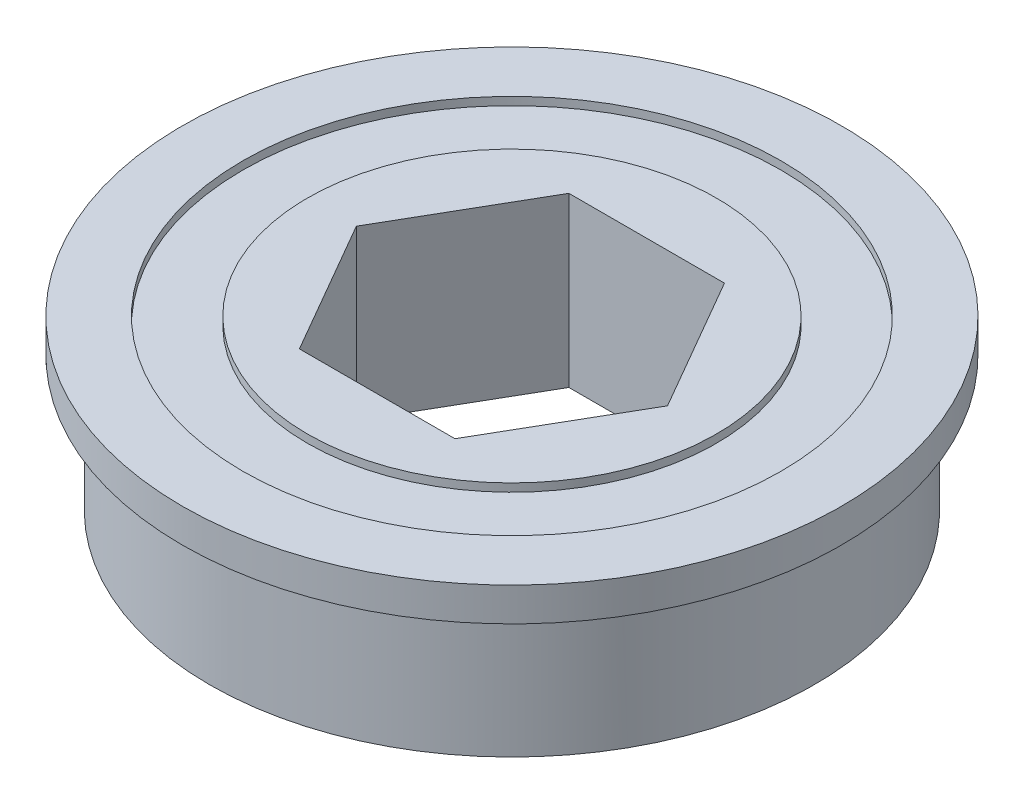
ISO-10303-21;
HEADER;
FILE_DESCRIPTION(('STEP AP214'),'2;1');
FILE_NAME('part.step','',(''),(''),'','','');
FILE_SCHEMA(('AUTOMOTIVE_DESIGN { 1 0 10303 214 1 1 1 1 }'));
ENDSEC;
DATA;
#1=APPLICATION_CONTEXT('core data for automotive mechanical design processes');
#2=APPLICATION_PROTOCOL_DEFINITION('international standard','automotive_design',2000,#1);
#3=PRODUCT_CONTEXT('',#1,'mechanical');
#4=PRODUCT('Part','Part','',(#3));
#5=PRODUCT_RELATED_PRODUCT_CATEGORY('part','',(#4));
#6=PRODUCT_DEFINITION_FORMATION('','',#4);
#7=PRODUCT_DEFINITION_CONTEXT('part definition',#1,'design');
#8=PRODUCT_DEFINITION('design','',#6,#7);
#9=PRODUCT_DEFINITION_SHAPE('','',#8);
#10=(LENGTH_UNIT() NAMED_UNIT(*) SI_UNIT(.MILLI.,.METRE.));
#11=(NAMED_UNIT(*) PLANE_ANGLE_UNIT() SI_UNIT($,.RADIAN.));
#12=(NAMED_UNIT(*) SI_UNIT($,.STERADIAN.) SOLID_ANGLE_UNIT());
#13=UNCERTAINTY_MEASURE_WITH_UNIT(LENGTH_MEASURE(1.E-05),#10,'distance_accuracy_value','');
#14=(GEOMETRIC_REPRESENTATION_CONTEXT(3) GLOBAL_UNCERTAINTY_ASSIGNED_CONTEXT((#13)) GLOBAL_UNIT_ASSIGNED_CONTEXT((#10,
#11,#12)) REPRESENTATION_CONTEXT('',''));
#15=CARTESIAN_POINT('',(0.,0.,0.));
#16=DIRECTION('',(0.,0.,1.));
#17=DIRECTION('',(1.,0.,0.));
#18=AXIS2_PLACEMENT_3D('',#15,#16,#17);
#19=CARTESIAN_POINT('',(0.,0.,0.));
#20=DIRECTION('',(0.,1.,0.));
#21=DIRECTION('',(0.,0.,1.));
#22=AXIS2_PLACEMENT_3D('',#19,#20,#21);
#23=CYLINDRICAL_SURFACE('',#22,12.7);
#24=CARTESIAN_POINT('',(0.,0.381,0.));
#25=DIRECTION('',(0.,1.,0.));
#26=DIRECTION('',(0.,0.,1.));
#27=AXIS2_PLACEMENT_3D('',#24,#25,#26);
#28=CIRCLE('',#27,12.7);
#29=CARTESIAN_POINT('',(0.,0.381,12.7));
#30=VERTEX_POINT('',#29);
#31=EDGE_CURVE('E128',#30,#30,#28,.F.);
#32=ORIENTED_EDGE('',*,*,#31,.F.);
#33=EDGE_LOOP('',(#32));
#34=FACE_BOUND('',#33,.T.);
#35=CARTESIAN_POINT('',(0.,0.,0.));
#36=DIRECTION('',(0.,1.,0.));
#37=DIRECTION('',(0.,0.,1.));
#38=AXIS2_PLACEMENT_3D('',#35,#36,#37);
#39=CIRCLE('',#38,12.7);
#40=CARTESIAN_POINT('',(0.,0.,12.7));
#41=VERTEX_POINT('',#40);
#42=EDGE_CURVE('E125',#41,#41,#39,.T.);
#43=ORIENTED_EDGE('',*,*,#42,.F.);
#44=EDGE_LOOP('',(#43));
#45=FACE_BOUND('',#44,.T.);
#46=ADVANCED_FACE('F16',(#34,#45),#23,.F.);
#47=CARTESIAN_POINT('',(9.652,0.381,0.));
#48=DIRECTION('',(0.,-1.,0.));
#49=DIRECTION('',(0.,0.,-1.));
#50=AXIS2_PLACEMENT_3D('',#47,#48,#49);
#51=PLANE('',#50);
#52=ORIENTED_EDGE('',*,*,#31,.T.);
#53=EDGE_LOOP('',(#52));
#54=FACE_BOUND('',#53,.T.);
#55=CARTESIAN_POINT('',(0.,0.381,0.));
#56=DIRECTION('',(0.,1.,0.));
#57=DIRECTION('',(0.,0.,1.));
#58=AXIS2_PLACEMENT_3D('',#55,#56,#57);
#59=CIRCLE('',#58,9.652);
#60=CARTESIAN_POINT('',(0.,0.381,9.652));
#61=VERTEX_POINT('',#60);
#62=EDGE_CURVE('E122',#61,#61,#59,.F.);
#63=ORIENTED_EDGE('',*,*,#62,.F.);
#64=EDGE_LOOP('',(#63));
#65=FACE_BOUND('',#64,.T.);
#66=ADVANCED_FACE('F357',(#54,#65),#51,.T.);
#67=CARTESIAN_POINT('',(14.2748,0.,0.));
#68=DIRECTION('',(0.,-1.,0.));
#69=DIRECTION('',(0.,0.,-1.));
#70=AXIS2_PLACEMENT_3D('',#67,#68,#69);
#71=PLANE('',#70);
#72=CARTESIAN_POINT('',(0.,0.,0.));
#73=DIRECTION('',(0.,1.,0.));
#74=DIRECTION('',(0.,0.,1.));
#75=AXIS2_PLACEMENT_3D('',#72,#73,#74);
#76=CIRCLE('',#75,14.2748);
#77=CARTESIAN_POINT('',(0.,0.,14.2748));
#78=VERTEX_POINT('',#77);
#79=EDGE_CURVE('E119',#78,#78,#76,.T.);
#80=ORIENTED_EDGE('',*,*,#79,.F.);
#81=EDGE_LOOP('',(#80));
#82=FACE_BOUND('',#81,.T.);
#83=ORIENTED_EDGE('',*,*,#42,.T.);
#84=EDGE_LOOP('',(#83));
#85=FACE_BOUND('',#84,.T.);
#86=ADVANCED_FACE('F347',(#82,#85),#71,.T.);
#87=CARTESIAN_POINT('',(0.,0.,0.));
#88=DIRECTION('',(0.,1.,0.));
#89=DIRECTION('',(0.,0.,1.));
#90=AXIS2_PLACEMENT_3D('',#87,#88,#89);
#91=CYLINDRICAL_SURFACE('',#90,9.652);
#92=CARTESIAN_POINT('',(0.,0.,0.));
#93=DIRECTION('',(0.,1.,0.));
#94=DIRECTION('',(0.,0.,1.));
#95=AXIS2_PLACEMENT_3D('',#92,#93,#94);
#96=CIRCLE('',#95,9.652);
#97=CARTESIAN_POINT('',(0.,0.,9.652));
#98=VERTEX_POINT('',#97);
#99=EDGE_CURVE('E99',#98,#98,#96,.F.);
#100=ORIENTED_EDGE('',*,*,#99,.F.);
#101=EDGE_LOOP('',(#100));
#102=FACE_BOUND('',#101,.T.);
#103=ORIENTED_EDGE('',*,*,#62,.T.);
#104=EDGE_LOOP('',(#103));
#105=FACE_BOUND('',#104,.T.);
#106=ADVANCED_FACE('F337',(#102,#105),#91,.T.);
#107=CARTESIAN_POINT('',(0.,0.,0.));
#108=DIRECTION('',(0.,1.,0.));
#109=DIRECTION('',(0.,0.,1.));
#110=AXIS2_PLACEMENT_3D('',#107,#108,#109);
#111=CYLINDRICAL_SURFACE('',#110,14.2748);
#112=ORIENTED_EDGE('',*,*,#79,.T.);
#113=EDGE_LOOP('',(#112));
#114=FACE_BOUND('',#113,.T.);
#115=CARTESIAN_POINT('',(0.,5.6,0.));
#116=DIRECTION('',(0.,-1.,0.));
#117=DIRECTION('',(0.,0.,-1.));
#118=AXIS2_PLACEMENT_3D('',#115,#116,#117);
#119=CIRCLE('',#118,14.2748);
#120=CARTESIAN_POINT('',(0.,5.6,-14.2748));
#121=VERTEX_POINT('',#120);
#122=EDGE_CURVE('E82',#121,#121,#119,.F.);
#123=ORIENTED_EDGE('',*,*,#122,.F.);
#124=EDGE_LOOP('',(#123));
#125=FACE_BOUND('',#124,.T.);
#126=ADVANCED_FACE('F327',(#114,#125),#111,.T.);
#127=CARTESIAN_POINT('',(9.652,0.,0.));
#128=DIRECTION('',(0.,-1.,0.));
#129=DIRECTION('',(0.,0.,-1.));
#130=AXIS2_PLACEMENT_3D('',#127,#128,#129);
#131=PLANE('',#130);
#132=ORIENTED_EDGE('',*,*,#99,.T.);
#133=EDGE_LOOP('',(#132));
#134=FACE_BOUND('',#133,.T.);
#135=DIRECTION('',(1.,0.,0.));
#136=VECTOR('',#135,1.);
#137=CARTESIAN_POINT('',(-3.67194771204601,0.,6.36));
#138=LINE('',#137,#136);
#139=CARTESIAN_POINT('',(-3.67194771204601,0.,6.36));
#140=VERTEX_POINT('',#139);
#141=CARTESIAN_POINT('',(3.67194771204602,0.,6.36));
#142=VERTEX_POINT('',#141);
#143=EDGE_CURVE('E61',#140,#142,#138,.T.);
#144=ORIENTED_EDGE('',*,*,#143,.T.);
#145=DIRECTION('',(0.5,0.,-0.866025403784439));
#146=VECTOR('',#145,1.);
#147=CARTESIAN_POINT('',(3.67194771204602,0.,6.36));
#148=LINE('',#147,#146);
#149=CARTESIAN_POINT('',(7.34389542409204,0.,0.));
#150=VERTEX_POINT('',#149);
#151=EDGE_CURVE('E63',#142,#150,#148,.T.);
#152=ORIENTED_EDGE('',*,*,#151,.T.);
#153=DIRECTION('',(-0.5,0.,-0.866025403784439));
#154=VECTOR('',#153,1.);
#155=CARTESIAN_POINT('',(7.34389542409204,0.,0.));
#156=LINE('',#155,#154);
#157=CARTESIAN_POINT('',(3.67194771204602,0.,-6.36));
#158=VERTEX_POINT('',#157);
#159=EDGE_CURVE('E66',#150,#158,#156,.T.);
#160=ORIENTED_EDGE('',*,*,#159,.T.);
#161=DIRECTION('',(-1.,0.,0.));
#162=VECTOR('',#161,1.);
#163=CARTESIAN_POINT('',(3.67194771204602,0.,-6.36));
#164=LINE('',#163,#162);
#165=CARTESIAN_POINT('',(-3.67194771204602,0.,-6.36));
#166=VERTEX_POINT('',#165);
#167=EDGE_CURVE('E191',#158,#166,#164,.T.);
#168=ORIENTED_EDGE('',*,*,#167,.T.);
#169=DIRECTION('',(-0.5,0.,0.866025403784439));
#170=VECTOR('',#169,1.);
#171=CARTESIAN_POINT('',(-3.67194771204602,0.,-6.36));
#172=LINE('',#171,#170);
#173=CARTESIAN_POINT('',(-7.34389542409204,0.,0.));
#174=VERTEX_POINT('',#173);
#175=EDGE_CURVE('E197',#166,#174,#172,.T.);
#176=ORIENTED_EDGE('',*,*,#175,.T.);
#177=DIRECTION('',(0.5,0.,0.866025403784439));
#178=VECTOR('',#177,1.);
#179=CARTESIAN_POINT('',(-7.34389542409204,0.,0.));
#180=LINE('',#179,#178);
#181=EDGE_CURVE('E202',#174,#140,#180,.T.);
#182=ORIENTED_EDGE('',*,*,#181,.T.);
#183=EDGE_LOOP('',(#144,#152,#160,#168,#176,#182));
#184=FACE_BOUND('',#183,.T.);
#185=ADVANCED_FACE('F65',(#134,#184),#131,.T.);
#186=CARTESIAN_POINT('',(0.,5.6,0.));
#187=DIRECTION('',(0.,-1.,0.));
#188=DIRECTION('',(0.,0.,-1.));
#189=AXIS2_PLACEMENT_3D('',#186,#187,#188);
#190=CONICAL_SURFACE('',#189,14.2748,0.523598775598298);
#191=CARTESIAN_POINT('',(0.,5.975,0.));
#192=DIRECTION('',(0.,1.,0.));
#193=DIRECTION('',(0.,0.,1.));
#194=AXIS2_PLACEMENT_3D('',#191,#192,#193);
#195=CIRCLE('',#194,14.0582936490539);
#196=CARTESIAN_POINT('',(0.,5.975,14.0582936490539));
#197=VERTEX_POINT('',#196);
#198=EDGE_CURVE('E93',#197,#197,#195,.F.);
#199=ORIENTED_EDGE('',*,*,#198,.T.);
#200=EDGE_LOOP('',(#199));
#201=FACE_BOUND('',#200,.T.);
#202=ORIENTED_EDGE('',*,*,#122,.T.);
#203=EDGE_LOOP('',(#202));
#204=FACE_BOUND('',#203,.T.);
#205=ADVANCED_FACE('F309',(#201,#204),#190,.T.);
#206=CARTESIAN_POINT('',(7.34389542409204,0.,0.));
#207=DIRECTION('',(0.866025403784439,0.,-0.5));
#208=DIRECTION('',(-0.5,0.,-0.866025403784439));
#209=AXIS2_PLACEMENT_3D('',#206,#207,#208);
#210=PLANE('',#209);
#211=DIRECTION('',(0.,1.,0.));
#212=VECTOR('',#211,1.);
#213=CARTESIAN_POINT('',(3.67194771204602,0.,-6.36));
#214=LINE('',#213,#212);
#215=CARTESIAN_POINT('',(3.67194771204602,7.9375,-6.36));
#216=VERTEX_POINT('',#215);
#217=EDGE_CURVE('E80',#216,#158,#214,.F.);
#218=ORIENTED_EDGE('',*,*,#217,.T.);
#219=ORIENTED_EDGE('',*,*,#159,.F.);
#220=DIRECTION('',(0.,1.,0.));
#221=VECTOR('',#220,1.);
#222=CARTESIAN_POINT('',(7.34389542409204,0.,0.));
#223=LINE('',#222,#221);
#224=CARTESIAN_POINT('',(7.34389542409204,7.9375,0.));
#225=VERTEX_POINT('',#224);
#226=EDGE_CURVE('E72',#150,#225,#223,.T.);
#227=ORIENTED_EDGE('',*,*,#226,.T.);
#228=DIRECTION('',(0.5,0.,0.866025403784438));
#229=VECTOR('',#228,1.);
#230=CARTESIAN_POINT('',(3.67194771204602,7.9375,-6.36));
#231=LINE('',#230,#229);
#232=EDGE_CURVE('E96',#216,#225,#231,.T.);
#233=ORIENTED_EDGE('',*,*,#232,.F.);
#234=EDGE_LOOP('',(#218,#219,#227,#233));
#235=FACE_BOUND('',#234,.T.);
#236=ADVANCED_FACE('F76',(#235),#210,.F.);
#237=CARTESIAN_POINT('',(3.67194771204602,0.,6.36));
#238=DIRECTION('',(0.866025403784439,0.,0.5));
#239=DIRECTION('',(0.5,0.,-0.866025403784439));
#240=AXIS2_PLACEMENT_3D('',#237,#238,#239);
#241=PLANE('',#240);
#242=ORIENTED_EDGE('',*,*,#226,.F.);
#243=ORIENTED_EDGE('',*,*,#151,.F.);
#244=DIRECTION('',(0.,1.,0.));
#245=VECTOR('',#244,1.);
#246=CARTESIAN_POINT('',(3.67194771204602,0.,6.36));
#247=LINE('',#246,#245);
#248=CARTESIAN_POINT('',(3.67194771204602,7.9375,6.36));
#249=VERTEX_POINT('',#248);
#250=EDGE_CURVE('E89',#142,#249,#247,.T.);
#251=ORIENTED_EDGE('',*,*,#250,.T.);
#252=DIRECTION('',(-0.5,0.,0.866025403784439));
#253=VECTOR('',#252,1.);
#254=CARTESIAN_POINT('',(7.34389542409204,7.9375,0.));
#255=LINE('',#254,#253);
#256=EDGE_CURVE('E86',#225,#249,#255,.T.);
#257=ORIENTED_EDGE('',*,*,#256,.F.);
#258=EDGE_LOOP('',(#242,#243,#251,#257));
#259=FACE_BOUND('',#258,.T.);
#260=ADVANCED_FACE('F84',(#259),#241,.F.);
#261=CARTESIAN_POINT('',(-3.67194771204601,0.,6.36));
#262=DIRECTION('',(0.,0.,1.));
#263=DIRECTION('',(1.,0.,0.));
#264=AXIS2_PLACEMENT_3D('',#261,#262,#263);
#265=PLANE('',#264);
#266=ORIENTED_EDGE('',*,*,#250,.F.);
#267=ORIENTED_EDGE('',*,*,#143,.F.);
#268=DIRECTION('',(0.,1.,0.));
#269=VECTOR('',#268,1.);
#270=CARTESIAN_POINT('',(-3.67194771204601,0.,6.36));
#271=LINE('',#270,#269);
#272=CARTESIAN_POINT('',(-3.67194771204601,7.9375,6.36));
#273=VERTEX_POINT('',#272);
#274=EDGE_CURVE('E199',#140,#273,#271,.T.);
#275=ORIENTED_EDGE('',*,*,#274,.T.);
#276=DIRECTION('',(1.,0.,0.));
#277=VECTOR('',#276,1.);
#278=CARTESIAN_POINT('',(6.35,7.9375,6.36));
#279=LINE('',#278,#277);
#280=EDGE_CURVE('E184',#249,#273,#279,.F.);
#281=ORIENTED_EDGE('',*,*,#280,.F.);
#282=EDGE_LOOP('',(#266,#267,#275,#281));
#283=FACE_BOUND('',#282,.T.);
#284=ADVANCED_FACE('F208',(#283),#265,.F.);
#285=CARTESIAN_POINT('',(-7.34389542409204,0.,0.));
#286=DIRECTION('',(-0.866025403784439,0.,0.5));
#287=DIRECTION('',(0.5,0.,0.866025403784439));
#288=AXIS2_PLACEMENT_3D('',#285,#286,#287);
#289=PLANE('',#288);
#290=ORIENTED_EDGE('',*,*,#274,.F.);
#291=ORIENTED_EDGE('',*,*,#181,.F.);
#292=DIRECTION('',(0.,1.,0.));
#293=VECTOR('',#292,1.);
#294=CARTESIAN_POINT('',(-7.34389542409204,0.,0.));
#295=LINE('',#294,#293);
#296=CARTESIAN_POINT('',(-7.34389542409204,7.9375,0.));
#297=VERTEX_POINT('',#296);
#298=EDGE_CURVE('E194',#174,#297,#295,.T.);
#299=ORIENTED_EDGE('',*,*,#298,.T.);
#300=DIRECTION('',(-0.5,0.,-0.866025403784439));
#301=VECTOR('',#300,1.);
#302=CARTESIAN_POINT('',(-3.67194771204601,7.9375,6.36));
#303=LINE('',#302,#301);
#304=EDGE_CURVE('E181',#273,#297,#303,.T.);
#305=ORIENTED_EDGE('',*,*,#304,.F.);
#306=EDGE_LOOP('',(#290,#291,#299,#305));
#307=FACE_BOUND('',#306,.T.);
#308=ADVANCED_FACE('F224',(#307),#289,.F.);
#309=CARTESIAN_POINT('',(-3.67194771204602,0.,-6.36));
#310=DIRECTION('',(-0.866025403784439,0.,-0.5));
#311=DIRECTION('',(-0.5,0.,0.866025403784439));
#312=AXIS2_PLACEMENT_3D('',#309,#310,#311);
#313=PLANE('',#312);
#314=ORIENTED_EDGE('',*,*,#298,.F.);
#315=ORIENTED_EDGE('',*,*,#175,.F.);
#316=DIRECTION('',(0.,1.,0.));
#317=VECTOR('',#316,1.);
#318=CARTESIAN_POINT('',(-3.67194771204602,0.,-6.36));
#319=LINE('',#318,#317);
#320=CARTESIAN_POINT('',(-3.67194771204602,7.9375,-6.36));
#321=VERTEX_POINT('',#320);
#322=EDGE_CURVE('E97',#166,#321,#319,.T.);
#323=ORIENTED_EDGE('',*,*,#322,.T.);
#324=DIRECTION('',(0.5,0.,-0.866025403784439));
#325=VECTOR('',#324,1.);
#326=CARTESIAN_POINT('',(-7.34389542409204,7.9375,0.));
#327=LINE('',#326,#325);
#328=EDGE_CURVE('E178',#297,#321,#327,.T.);
#329=ORIENTED_EDGE('',*,*,#328,.F.);
#330=EDGE_LOOP('',(#314,#315,#323,#329));
#331=FACE_BOUND('',#330,.T.);
#332=ADVANCED_FACE('F220',(#331),#313,.F.);
#333=CARTESIAN_POINT('',(3.67194771204602,0.,-6.36));
#334=DIRECTION('',(0.,0.,-1.));
#335=DIRECTION('',(-1.,0.,0.));
#336=AXIS2_PLACEMENT_3D('',#333,#334,#335);
#337=PLANE('',#336);
#338=ORIENTED_EDGE('',*,*,#322,.F.);
#339=ORIENTED_EDGE('',*,*,#167,.F.);
#340=ORIENTED_EDGE('',*,*,#217,.F.);
#341=DIRECTION('',(1.,0.,0.));
#342=VECTOR('',#341,1.);
#343=CARTESIAN_POINT('',(6.35,7.9375,-6.36));
#344=LINE('',#343,#342);
#345=EDGE_CURVE('E116',#321,#216,#344,.T.);
#346=ORIENTED_EDGE('',*,*,#345,.F.);
#347=EDGE_LOOP('',(#338,#339,#340,#346));
#348=FACE_BOUND('',#347,.T.);
#349=ADVANCED_FACE('F215',(#348),#337,.F.);
#350=CARTESIAN_POINT('',(6.35,7.9375,0.));
#351=DIRECTION('',(0.,1.,0.));
#352=DIRECTION('',(0.,0.,1.));
#353=AXIS2_PLACEMENT_3D('',#350,#351,#352);
#354=PLANE('',#353);
#355=CARTESIAN_POINT('',(0.,7.9375,0.));
#356=DIRECTION('',(0.,1.,0.));
#357=DIRECTION('',(0.,0.,1.));
#358=AXIS2_PLACEMENT_3D('',#355,#356,#357);
#359=CIRCLE('',#358,9.652);
#360=CARTESIAN_POINT('',(0.,7.9375,9.652));
#361=VERTEX_POINT('',#360);
#362=EDGE_CURVE('E112',#361,#361,#359,.F.);
#363=ORIENTED_EDGE('',*,*,#362,.F.);
#364=EDGE_LOOP('',(#363));
#365=FACE_BOUND('',#364,.T.);
#366=ORIENTED_EDGE('',*,*,#328,.T.);
#367=ORIENTED_EDGE('',*,*,#345,.T.);
#368=ORIENTED_EDGE('',*,*,#232,.T.);
#369=ORIENTED_EDGE('',*,*,#256,.T.);
#370=ORIENTED_EDGE('',*,*,#280,.T.);
#371=ORIENTED_EDGE('',*,*,#304,.T.);
#372=EDGE_LOOP('',(#366,#367,#368,#369,#370,#371));
#373=FACE_BOUND('',#372,.T.);
#374=ADVANCED_FACE('F163',(#365,#373),#354,.T.);
#375=CARTESIAN_POINT('',(0.,6.1,0.));
#376=DIRECTION('',(0.,1.,0.));
#377=DIRECTION('',(0.,0.,1.));
#378=AXIS2_PLACEMENT_3D('',#375,#376,#377);
#379=TOROIDAL_SURFACE('',#378,14.2748,0.25);
#380=ORIENTED_EDGE('',*,*,#198,.F.);
#381=EDGE_LOOP('',(#380));
#382=FACE_BOUND('',#381,.T.);
#383=CARTESIAN_POINT('',(0.,6.35,0.));
#384=DIRECTION('',(0.,-1.,0.));
#385=DIRECTION('',(0.,0.,-1.));
#386=AXIS2_PLACEMENT_3D('',#383,#384,#385);
#387=CIRCLE('',#386,14.2748);
#388=CARTESIAN_POINT('',(0.,6.35,14.2748));
#389=VERTEX_POINT('',#388);
#390=CARTESIAN_POINT('',(0.,6.35,-14.2748));
#391=VERTEX_POINT('',#390);
#392=EDGE_CURVE('E115',#389,#391,#387,.F.);
#393=ORIENTED_EDGE('',*,*,#392,.F.);
#394=CARTESIAN_POINT('',(0.,6.35,0.));
#395=DIRECTION('',(0.,-1.,0.));
#396=DIRECTION('',(0.,0.,1.));
#397=AXIS2_PLACEMENT_3D('',#394,#395,#396);
#398=CIRCLE('',#397,14.2748);
#399=EDGE_CURVE('E35',#391,#389,#398,.F.);
#400=ORIENTED_EDGE('',*,*,#399,.F.);
#401=EDGE_LOOP('',(#393,#400));
#402=FACE_BOUND('',#401,.T.);
#403=ADVANCED_FACE('F130',(#382,#402),#379,.F.);
#404=CARTESIAN_POINT('',(0.,0.,0.));
#405=DIRECTION('',(0.,1.,0.));
#406=DIRECTION('',(0.,0.,1.));
#407=AXIS2_PLACEMENT_3D('',#404,#405,#406);
#408=CYLINDRICAL_SURFACE('',#407,9.652);
#409=CARTESIAN_POINT('',(0.,7.5565,0.));
#410=DIRECTION('',(0.,1.,0.));
#411=DIRECTION('',(0.,0.,1.));
#412=AXIS2_PLACEMENT_3D('',#409,#410,#411);
#413=CIRCLE('',#412,9.652);
#414=CARTESIAN_POINT('',(0.,7.5565,9.652));
#415=VERTEX_POINT('',#414);
#416=EDGE_CURVE('E109',#415,#415,#413,.F.);
#417=ORIENTED_EDGE('',*,*,#416,.F.);
#418=EDGE_LOOP('',(#417));
#419=FACE_BOUND('',#418,.T.);
#420=ORIENTED_EDGE('',*,*,#362,.T.);
#421=EDGE_LOOP('',(#420));
#422=FACE_BOUND('',#421,.T.);
#423=ADVANCED_FACE('F154',(#419,#422),#408,.T.);
#424=CARTESIAN_POINT('',(15.5575,6.35,0.));
#425=DIRECTION('',(0.,-1.,0.));
#426=DIRECTION('',(0.,0.,-1.));
#427=AXIS2_PLACEMENT_3D('',#424,#425,#426);
#428=PLANE('',#427);
#429=CARTESIAN_POINT('',(0.,6.35,0.));
#430=DIRECTION('',(0.,1.,0.));
#431=DIRECTION('',(0.,0.,1.));
#432=AXIS2_PLACEMENT_3D('',#429,#430,#431);
#433=CIRCLE('',#432,15.5575);
#434=CARTESIAN_POINT('',(0.,6.35,15.5575));
#435=VERTEX_POINT('',#434);
#436=EDGE_CURVE('E106',#435,#435,#433,.T.);
#437=ORIENTED_EDGE('',*,*,#436,.F.);
#438=EDGE_LOOP('',(#437));
#439=FACE_BOUND('',#438,.T.);
#440=ORIENTED_EDGE('',*,*,#392,.T.);
#441=ORIENTED_EDGE('',*,*,#399,.T.);
#442=EDGE_LOOP('',(#440,#441));
#443=FACE_BOUND('',#442,.T.);
#444=ADVANCED_FACE('F134',(#439,#443),#428,.T.);
#445=CARTESIAN_POINT('',(9.652,7.5565,0.));
#446=DIRECTION('',(0.,1.,0.));
#447=DIRECTION('',(0.,0.,1.));
#448=AXIS2_PLACEMENT_3D('',#445,#446,#447);
#449=PLANE('',#448);
#450=ORIENTED_EDGE('',*,*,#416,.T.);
#451=EDGE_LOOP('',(#450));
#452=FACE_BOUND('',#451,.T.);
#453=CARTESIAN_POINT('',(0.,7.5565,0.));
#454=DIRECTION('',(0.,1.,0.));
#455=DIRECTION('',(0.,0.,1.));
#456=AXIS2_PLACEMENT_3D('',#453,#454,#455);
#457=CIRCLE('',#456,12.7);
#458=CARTESIAN_POINT('',(0.,7.5565,12.7));
#459=VERTEX_POINT('',#458);
#460=EDGE_CURVE('E103',#459,#459,#457,.T.);
#461=ORIENTED_EDGE('',*,*,#460,.T.);
#462=EDGE_LOOP('',(#461));
#463=FACE_BOUND('',#462,.T.);
#464=ADVANCED_FACE('F153',(#452,#463),#449,.T.);
#465=CARTESIAN_POINT('',(0.,0.,0.));
#466=DIRECTION('',(0.,1.,0.));
#467=DIRECTION('',(0.,0.,1.));
#468=AXIS2_PLACEMENT_3D('',#465,#466,#467);
#469=CYLINDRICAL_SURFACE('',#468,15.5575);
#470=ORIENTED_EDGE('',*,*,#436,.T.);
#471=EDGE_LOOP('',(#470));
#472=FACE_BOUND('',#471,.T.);
#473=CARTESIAN_POINT('',(0.,7.9375,0.));
#474=DIRECTION('',(0.,1.,0.));
#475=DIRECTION('',(0.,0.,1.));
#476=AXIS2_PLACEMENT_3D('',#473,#474,#475);
#477=CIRCLE('',#476,15.5575);
#478=CARTESIAN_POINT('',(0.,7.9375,15.5575));
#479=VERTEX_POINT('',#478);
#480=EDGE_CURVE('E27',#479,#479,#477,.T.);
#481=ORIENTED_EDGE('',*,*,#480,.F.);
#482=EDGE_LOOP('',(#481));
#483=FACE_BOUND('',#482,.T.);
#484=ADVANCED_FACE('F245',(#472,#483),#469,.T.);
#485=CARTESIAN_POINT('',(0.,0.,0.));
#486=DIRECTION('',(0.,1.,0.));
#487=DIRECTION('',(0.,0.,1.));
#488=AXIS2_PLACEMENT_3D('',#485,#486,#487);
#489=CYLINDRICAL_SURFACE('',#488,12.7);
#490=CARTESIAN_POINT('',(0.,7.9375,0.));
#491=DIRECTION('',(0.,1.,0.));
#492=DIRECTION('',(0.,0.,1.));
#493=AXIS2_PLACEMENT_3D('',#490,#491,#492);
#494=CIRCLE('',#493,12.7);
#495=CARTESIAN_POINT('',(0.,7.9375,12.7));
#496=VERTEX_POINT('',#495);
#497=EDGE_CURVE('E11',#496,#496,#494,.F.);
#498=ORIENTED_EDGE('',*,*,#497,.F.);
#499=EDGE_LOOP('',(#498));
#500=FACE_BOUND('',#499,.T.);
#501=ORIENTED_EDGE('',*,*,#460,.F.);
#502=EDGE_LOOP('',(#501));
#503=FACE_BOUND('',#502,.T.);
#504=ADVANCED_FACE('F239',(#500,#503),#489,.F.);
#505=CARTESIAN_POINT('',(12.7,7.9375,0.));
#506=DIRECTION('',(0.,1.,0.));
#507=DIRECTION('',(0.,0.,1.));
#508=AXIS2_PLACEMENT_3D('',#505,#506,#507);
#509=PLANE('',#508);
#510=ORIENTED_EDGE('',*,*,#497,.T.);
#511=EDGE_LOOP('',(#510));
#512=FACE_BOUND('',#511,.T.);
#513=ORIENTED_EDGE('',*,*,#480,.T.);
#514=EDGE_LOOP('',(#513));
#515=FACE_BOUND('',#514,.T.);
#516=ADVANCED_FACE('F237',(#512,#515),#509,.T.);
#517=CLOSED_SHELL('',(#46,#66,#86,#106,#126,#185,#205,#236,#260,#284,#308,#332,#349,#374,#403,
#423,#444,#464,#484,#504,#516));
#518=MANIFOLD_SOLID_BREP('B1',#517);
#519=ADVANCED_BREP_SHAPE_REPRESENTATION('',(#18,#518),#14);
#520=SHAPE_DEFINITION_REPRESENTATION(#9,#519);
ENDSEC;
END-ISO-10303-21;
